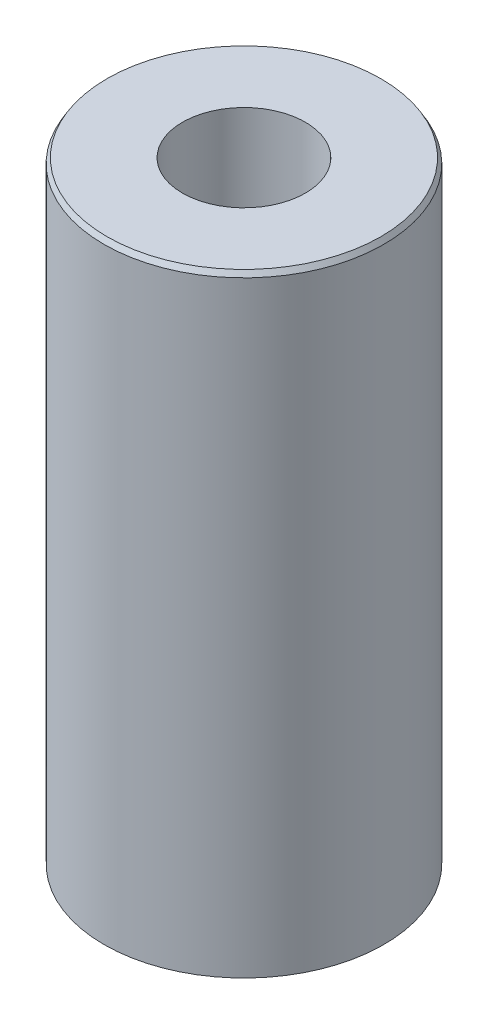
ISO-10303-21;
HEADER;
FILE_DESCRIPTION(('STEP AP214'),'2;1');
FILE_NAME('part.step','',(''),(''),'','','');
FILE_SCHEMA(('AUTOMOTIVE_DESIGN { 1 0 10303 214 1 1 1 1 }'));
ENDSEC;
DATA;
#1=APPLICATION_CONTEXT('core data for automotive mechanical design processes');
#2=APPLICATION_PROTOCOL_DEFINITION('international standard','automotive_design',2000,#1);
#3=PRODUCT_CONTEXT('',#1,'mechanical');
#4=PRODUCT('Part','Part','',(#3));
#5=PRODUCT_RELATED_PRODUCT_CATEGORY('part','',(#4));
#6=PRODUCT_DEFINITION_FORMATION('','',#4);
#7=PRODUCT_DEFINITION_CONTEXT('part definition',#1,'design');
#8=PRODUCT_DEFINITION('design','',#6,#7);
#9=PRODUCT_DEFINITION_SHAPE('','',#8);
#10=(LENGTH_UNIT() NAMED_UNIT(*) SI_UNIT(.MILLI.,.METRE.));
#11=(NAMED_UNIT(*) PLANE_ANGLE_UNIT() SI_UNIT($,.RADIAN.));
#12=(NAMED_UNIT(*) SI_UNIT($,.STERADIAN.) SOLID_ANGLE_UNIT());
#13=UNCERTAINTY_MEASURE_WITH_UNIT(LENGTH_MEASURE(1.E-05),#10,'distance_accuracy_value','');
#14=(GEOMETRIC_REPRESENTATION_CONTEXT(3) GLOBAL_UNCERTAINTY_ASSIGNED_CONTEXT((#13)) GLOBAL_UNIT_ASSIGNED_CONTEXT((#10,
#11,#12)) REPRESENTATION_CONTEXT('',''));
#15=CARTESIAN_POINT('',(0.,0.,0.));
#16=DIRECTION('',(0.,0.,1.));
#17=DIRECTION('',(1.,0.,0.));
#18=AXIS2_PLACEMENT_3D('',#15,#16,#17);
#19=CARTESIAN_POINT('',(0.,65.8950367261846,0.));
#20=DIRECTION('',(0.,-1.,0.));
#21=DIRECTION('',(0.,0.,-1.));
#22=AXIS2_PLACEMENT_3D('',#19,#20,#21);
#23=CYLINDRICAL_SURFACE('',#22,15.);
#24=CARTESIAN_POINT('',(0.,65.339568908964,0.));
#25=DIRECTION('',(0.,1.,0.));
#26=DIRECTION('',(0.,0.,1.));
#27=AXIS2_PLACEMENT_3D('',#24,#25,#26);
#28=CIRCLE('',#27,15.);
#29=CARTESIAN_POINT('',(0.,65.339568908964,15.));
#30=VERTEX_POINT('',#29);
#31=EDGE_CURVE('E50',#30,#30,#28,.F.);
#32=ORIENTED_EDGE('',*,*,#31,.T.);
#33=EDGE_LOOP('',(#32));
#34=FACE_BOUND('',#33,.T.);
#35=CARTESIAN_POINT('',(0.,0.320699493798482,0.));
#36=DIRECTION('',(0.,1.,0.));
#37=DIRECTION('',(0.,0.,1.));
#38=AXIS2_PLACEMENT_3D('',#35,#36,#37);
#39=CIRCLE('',#38,15.);
#40=CARTESIAN_POINT('',(0.,0.320699493798482,15.));
#41=VERTEX_POINT('',#40);
#42=EDGE_CURVE('E51',#41,#41,#39,.T.);
#43=ORIENTED_EDGE('',*,*,#42,.T.);
#44=EDGE_LOOP('',(#43));
#45=FACE_BOUND('',#44,.T.);
#46=ADVANCED_FACE('F39',(#34,#45),#23,.T.);
#47=CARTESIAN_POINT('',(0.,65.8950367261846,0.));
#48=DIRECTION('',(0.,1.,0.));
#49=DIRECTION('',(0.,0.,1.));
#50=AXIS2_PLACEMENT_3D('',#47,#48,#49);
#51=PLANE('',#50);
#52=CARTESIAN_POINT('',(0.,65.8950367261846,0.));
#53=DIRECTION('',(0.,1.,0.));
#54=DIRECTION('',(0.,0.,1.));
#55=AXIS2_PLACEMENT_3D('',#52,#53,#54);
#56=CIRCLE('',#55,14.6793005062015);
#57=CARTESIAN_POINT('',(0.,65.8950367261846,14.6793005062015));
#58=VERTEX_POINT('',#57);
#59=EDGE_CURVE('E54',#58,#58,#56,.T.);
#60=ORIENTED_EDGE('',*,*,#59,.T.);
#61=EDGE_LOOP('',(#60));
#62=FACE_BOUND('',#61,.T.);
#63=CARTESIAN_POINT('',(0.,65.8950367261846,0.));
#64=DIRECTION('',(0.,1.,0.));
#65=DIRECTION('',(0.,0.,1.));
#66=AXIS2_PLACEMENT_3D('',#63,#64,#65);
#67=CIRCLE('',#66,6.59074562327624);
#68=CARTESIAN_POINT('',(0.,65.8950367261846,6.59074562327624));
#69=VERTEX_POINT('',#68);
#70=EDGE_CURVE('E58',#69,#69,#67,.T.);
#71=ORIENTED_EDGE('',*,*,#70,.F.);
#72=EDGE_LOOP('',(#71));
#73=FACE_BOUND('',#72,.T.);
#74=ADVANCED_FACE('F69',(#62,#73),#51,.T.);
#75=CARTESIAN_POINT('',(0.,0.,0.));
#76=DIRECTION('',(0.,1.,0.));
#77=DIRECTION('',(0.,0.,1.));
#78=AXIS2_PLACEMENT_3D('',#75,#76,#77);
#79=PLANE('',#78);
#80=CARTESIAN_POINT('',(0.,0.,0.));
#81=DIRECTION('',(0.,1.,0.));
#82=DIRECTION('',(0.,0.,1.));
#83=AXIS2_PLACEMENT_3D('',#80,#81,#82);
#84=CIRCLE('',#83,14.4445321827794);
#85=CARTESIAN_POINT('',(0.,0.,14.4445321827794));
#86=VERTEX_POINT('',#85);
#87=EDGE_CURVE('E10',#86,#86,#84,.F.);
#88=ORIENTED_EDGE('',*,*,#87,.T.);
#89=EDGE_LOOP('',(#88));
#90=FACE_BOUND('',#89,.T.);
#91=CARTESIAN_POINT('',(0.,0.,0.));
#92=DIRECTION('',(0.,1.,0.));
#93=DIRECTION('',(0.,0.,1.));
#94=AXIS2_PLACEMENT_3D('',#91,#92,#93);
#95=CIRCLE('',#94,6.59074562327624);
#96=CARTESIAN_POINT('',(0.,0.,6.59074562327624));
#97=VERTEX_POINT('',#96);
#98=EDGE_CURVE('E63',#97,#97,#95,.T.);
#99=ORIENTED_EDGE('',*,*,#98,.T.);
#100=EDGE_LOOP('',(#99));
#101=FACE_BOUND('',#100,.T.);
#102=ADVANCED_FACE('F75',(#90,#101),#79,.F.);
#103=CARTESIAN_POINT('',(0.,65.8950367261846,0.));
#104=DIRECTION('',(0.,-1.,0.));
#105=DIRECTION('',(0.,0.,-1.));
#106=AXIS2_PLACEMENT_3D('',#103,#104,#105);
#107=CYLINDRICAL_SURFACE('',#106,6.59074562327624);
#108=ORIENTED_EDGE('',*,*,#70,.T.);
#109=EDGE_LOOP('',(#108));
#110=FACE_BOUND('',#109,.T.);
#111=ORIENTED_EDGE('',*,*,#98,.F.);
#112=EDGE_LOOP('',(#111));
#113=FACE_BOUND('',#112,.T.);
#114=ADVANCED_FACE('F70',(#110,#113),#107,.F.);
#115=CARTESIAN_POINT('',(0.,65.8950367261846,0.));
#116=DIRECTION('',(0.,-1.,0.));
#117=DIRECTION('',(0.,0.,-1.));
#118=AXIS2_PLACEMENT_3D('',#115,#116,#117);
#119=CONICAL_SURFACE('',#118,14.6793005062015,0.523598775598291);
#120=ORIENTED_EDGE('',*,*,#31,.F.);
#121=EDGE_LOOP('',(#120));
#122=FACE_BOUND('',#121,.T.);
#123=ORIENTED_EDGE('',*,*,#59,.F.);
#124=EDGE_LOOP('',(#123));
#125=FACE_BOUND('',#124,.T.);
#126=ADVANCED_FACE('F81',(#122,#125),#119,.T.);
#127=CARTESIAN_POINT('',(0.,0.320699493798482,0.));
#128=DIRECTION('',(0.,1.,0.));
#129=DIRECTION('',(0.,0.,1.));
#130=AXIS2_PLACEMENT_3D('',#127,#128,#129);
#131=CONICAL_SURFACE('',#130,15.,1.04719755119661);
#132=ORIENTED_EDGE('',*,*,#87,.F.);
#133=EDGE_LOOP('',(#132));
#134=FACE_BOUND('',#133,.T.);
#135=ORIENTED_EDGE('',*,*,#42,.F.);
#136=EDGE_LOOP('',(#135));
#137=FACE_BOUND('',#136,.T.);
#138=ADVANCED_FACE('F45',(#134,#137),#131,.T.);
#139=CLOSED_SHELL('',(#46,#74,#102,#114,#126,#138));
#140=MANIFOLD_SOLID_BREP('B2',#139);
#141=ADVANCED_BREP_SHAPE_REPRESENTATION('',(#18,#140),#14);
#142=SHAPE_DEFINITION_REPRESENTATION(#9,#141);
ENDSEC;
END-ISO-10303-21;
